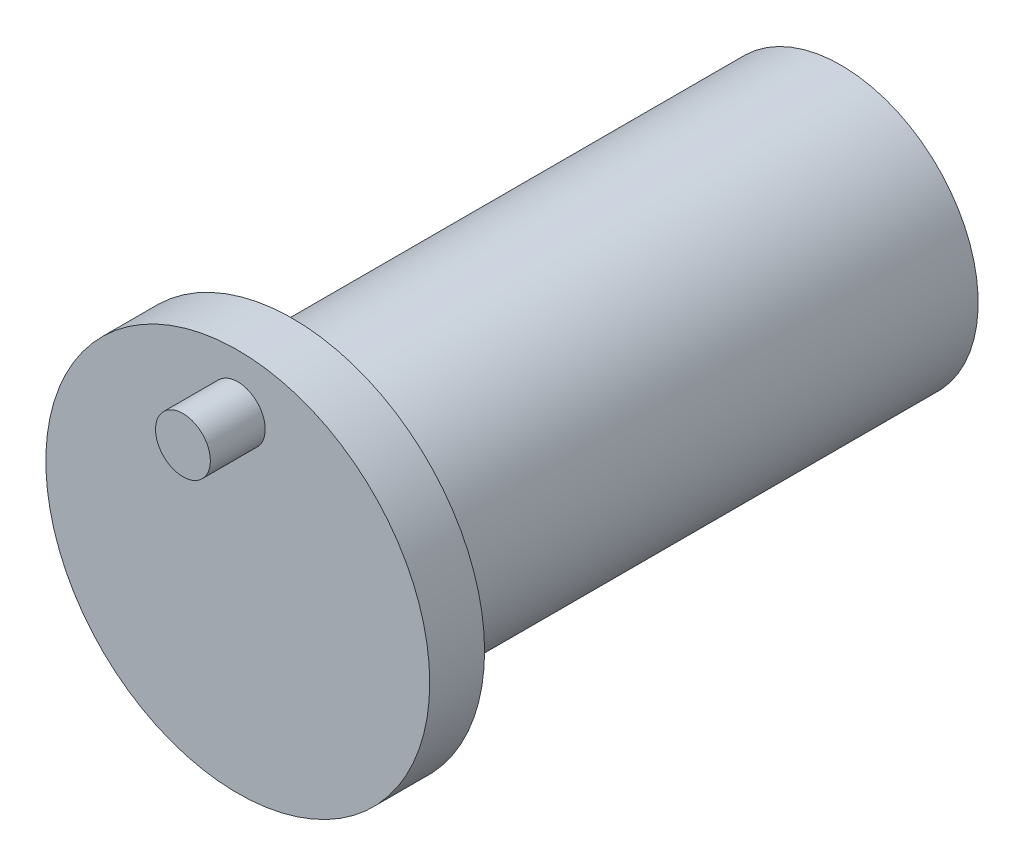
ISO-10303-21;
HEADER;
FILE_DESCRIPTION(('STEP AP214'),'2;1');
FILE_NAME('part.step','',(''),(''),'','','');
FILE_SCHEMA(('AUTOMOTIVE_DESIGN { 1 0 10303 214 1 1 1 1 }'));
ENDSEC;
DATA;
#1=APPLICATION_CONTEXT('core data for automotive mechanical design processes');
#2=APPLICATION_PROTOCOL_DEFINITION('international standard','automotive_design',2000,#1);
#3=PRODUCT_CONTEXT('',#1,'mechanical');
#4=PRODUCT('Part','Part','',(#3));
#5=PRODUCT_RELATED_PRODUCT_CATEGORY('part','',(#4));
#6=PRODUCT_DEFINITION_FORMATION('','',#4);
#7=PRODUCT_DEFINITION_CONTEXT('part definition',#1,'design');
#8=PRODUCT_DEFINITION('design','',#6,#7);
#9=PRODUCT_DEFINITION_SHAPE('','',#8);
#10=(LENGTH_UNIT() NAMED_UNIT(*) SI_UNIT(.MILLI.,.METRE.));
#11=(NAMED_UNIT(*) PLANE_ANGLE_UNIT() SI_UNIT($,.RADIAN.));
#12=(NAMED_UNIT(*) SI_UNIT($,.STERADIAN.) SOLID_ANGLE_UNIT());
#13=UNCERTAINTY_MEASURE_WITH_UNIT(LENGTH_MEASURE(1.E-05),#10,'distance_accuracy_value','');
#14=(GEOMETRIC_REPRESENTATION_CONTEXT(3) GLOBAL_UNCERTAINTY_ASSIGNED_CONTEXT((#13)) GLOBAL_UNIT_ASSIGNED_CONTEXT((#10,
#11,#12)) REPRESENTATION_CONTEXT('',''));
#15=CARTESIAN_POINT('',(0.,0.,0.));
#16=DIRECTION('',(0.,0.,1.));
#17=DIRECTION('',(1.,0.,0.));
#18=AXIS2_PLACEMENT_3D('',#15,#16,#17);
#19=CARTESIAN_POINT('',(0.,0.,-2.));
#20=DIRECTION('',(0.,0.,1.));
#21=DIRECTION('',(1.,0.,0.));
#22=AXIS2_PLACEMENT_3D('',#19,#20,#21);
#23=CYLINDRICAL_SURFACE('',#22,7.);
#24=CARTESIAN_POINT('',(0.,0.,-2.));
#25=DIRECTION('',(0.,0.,1.));
#26=DIRECTION('',(1.,0.,0.));
#27=AXIS2_PLACEMENT_3D('',#24,#25,#26);
#28=CIRCLE('',#27,7.);
#29=CARTESIAN_POINT('',(7.,0.,-2.));
#30=VERTEX_POINT('',#29);
#31=EDGE_CURVE('E49',#30,#30,#28,.T.);
#32=ORIENTED_EDGE('',*,*,#31,.T.);
#33=EDGE_LOOP('',(#32));
#34=FACE_BOUND('',#33,.T.);
#35=CARTESIAN_POINT('',(0.,0.,0.));
#36=DIRECTION('',(0.,0.,1.));
#37=DIRECTION('',(1.,0.,0.));
#38=AXIS2_PLACEMENT_3D('',#35,#36,#37);
#39=CIRCLE('',#38,7.);
#40=CARTESIAN_POINT('',(7.,0.,0.));
#41=VERTEX_POINT('',#40);
#42=EDGE_CURVE('E45',#41,#41,#39,.T.);
#43=ORIENTED_EDGE('',*,*,#42,.F.);
#44=EDGE_LOOP('',(#43));
#45=FACE_BOUND('',#44,.T.);
#46=ADVANCED_FACE('F42',(#34,#45),#23,.T.);
#47=CARTESIAN_POINT('',(0.,0.,-2.));
#48=DIRECTION('',(0.,0.,1.));
#49=DIRECTION('',(1.,0.,0.));
#50=AXIS2_PLACEMENT_3D('',#47,#48,#49);
#51=PLANE('',#50);
#52=CARTESIAN_POINT('',(0.,0.,-2.));
#53=DIRECTION('',(0.,0.,-1.));
#54=DIRECTION('',(-1.,0.,0.));
#55=AXIS2_PLACEMENT_3D('',#52,#53,#54);
#56=CIRCLE('',#55,5.);
#57=CARTESIAN_POINT('',(-5.,0.,-2.));
#58=VERTEX_POINT('',#57);
#59=EDGE_CURVE('E10',#58,#58,#56,.T.);
#60=ORIENTED_EDGE('',*,*,#59,.F.);
#61=EDGE_LOOP('',(#60));
#62=FACE_BOUND('',#61,.T.);
#63=ORIENTED_EDGE('',*,*,#31,.F.);
#64=EDGE_LOOP('',(#63));
#65=FACE_BOUND('',#64,.T.);
#66=ADVANCED_FACE('F83',(#62,#65),#51,.F.);
#67=CARTESIAN_POINT('',(0.,0.,0.));
#68=DIRECTION('',(0.,0.,1.));
#69=DIRECTION('',(1.,0.,0.));
#70=AXIS2_PLACEMENT_3D('',#67,#68,#69);
#71=PLANE('',#70);
#72=CARTESIAN_POINT('',(0.,5.,0.));
#73=DIRECTION('',(0.,0.,1.));
#74=DIRECTION('',(1.,0.,0.));
#75=AXIS2_PLACEMENT_3D('',#72,#73,#74);
#76=CIRCLE('',#75,1.);
#77=CARTESIAN_POINT('',(1.,5.,0.));
#78=VERTEX_POINT('',#77);
#79=EDGE_CURVE('E60',#78,#78,#76,.T.);
#80=ORIENTED_EDGE('',*,*,#79,.F.);
#81=EDGE_LOOP('',(#80));
#82=FACE_BOUND('',#81,.T.);
#83=ORIENTED_EDGE('',*,*,#42,.T.);
#84=EDGE_LOOP('',(#83));
#85=FACE_BOUND('',#84,.T.);
#86=ADVANCED_FACE('F88',(#82,#85),#71,.T.);
#87=CARTESIAN_POINT('',(0.,5.,2.));
#88=DIRECTION('',(0.,0.,-1.));
#89=DIRECTION('',(-1.,0.,0.));
#90=AXIS2_PLACEMENT_3D('',#87,#88,#89);
#91=CYLINDRICAL_SURFACE('',#90,1.);
#92=CARTESIAN_POINT('',(0.,5.,2.));
#93=DIRECTION('',(0.,0.,1.));
#94=DIRECTION('',(1.,0.,0.));
#95=AXIS2_PLACEMENT_3D('',#92,#93,#94);
#96=CIRCLE('',#95,1.);
#97=CARTESIAN_POINT('',(1.,5.,2.));
#98=VERTEX_POINT('',#97);
#99=EDGE_CURVE('E57',#98,#98,#96,.T.);
#100=ORIENTED_EDGE('',*,*,#99,.F.);
#101=EDGE_LOOP('',(#100));
#102=FACE_BOUND('',#101,.T.);
#103=ORIENTED_EDGE('',*,*,#79,.T.);
#104=EDGE_LOOP('',(#103));
#105=FACE_BOUND('',#104,.T.);
#106=ADVANCED_FACE('F79',(#102,#105),#91,.T.);
#107=CARTESIAN_POINT('',(0.,5.,2.));
#108=DIRECTION('',(0.,0.,1.));
#109=DIRECTION('',(1.,0.,0.));
#110=AXIS2_PLACEMENT_3D('',#107,#108,#109);
#111=PLANE('',#110);
#112=ORIENTED_EDGE('',*,*,#99,.T.);
#113=EDGE_LOOP('',(#112));
#114=FACE_BOUND('',#113,.T.);
#115=ADVANCED_FACE('F71',(#114),#111,.T.);
#116=CARTESIAN_POINT('',(0.,0.,-22.));
#117=DIRECTION('',(0.,0.,1.));
#118=DIRECTION('',(1.,0.,0.));
#119=AXIS2_PLACEMENT_3D('',#116,#117,#118);
#120=CYLINDRICAL_SURFACE('',#119,5.);
#121=CARTESIAN_POINT('',(0.,0.,-22.));
#122=DIRECTION('',(0.,0.,-1.));
#123=DIRECTION('',(-1.,0.,0.));
#124=AXIS2_PLACEMENT_3D('',#121,#122,#123);
#125=CIRCLE('',#124,5.);
#126=CARTESIAN_POINT('',(-5.,0.,-22.));
#127=VERTEX_POINT('',#126);
#128=EDGE_CURVE('E56',#127,#127,#125,.T.);
#129=ORIENTED_EDGE('',*,*,#128,.F.);
#130=EDGE_LOOP('',(#129));
#131=FACE_BOUND('',#130,.T.);
#132=ORIENTED_EDGE('',*,*,#59,.T.);
#133=EDGE_LOOP('',(#132));
#134=FACE_BOUND('',#133,.T.);
#135=ADVANCED_FACE('F69',(#131,#134),#120,.T.);
#136=CARTESIAN_POINT('',(0.,0.,-22.));
#137=DIRECTION('',(0.,0.,-1.));
#138=DIRECTION('',(-1.,0.,0.));
#139=AXIS2_PLACEMENT_3D('',#136,#137,#138);
#140=PLANE('',#139);
#141=ORIENTED_EDGE('',*,*,#128,.T.);
#142=EDGE_LOOP('',(#141));
#143=FACE_BOUND('',#142,.T.);
#144=ADVANCED_FACE('F67',(#143),#140,.T.);
#145=CLOSED_SHELL('',(#46,#66,#86,#106,#115,#135,#144));
#146=MANIFOLD_SOLID_BREP('B2',#145);
#147=ADVANCED_BREP_SHAPE_REPRESENTATION('',(#18,#146),#14);
#148=SHAPE_DEFINITION_REPRESENTATION(#9,#147);
ENDSEC;
END-ISO-10303-21;
